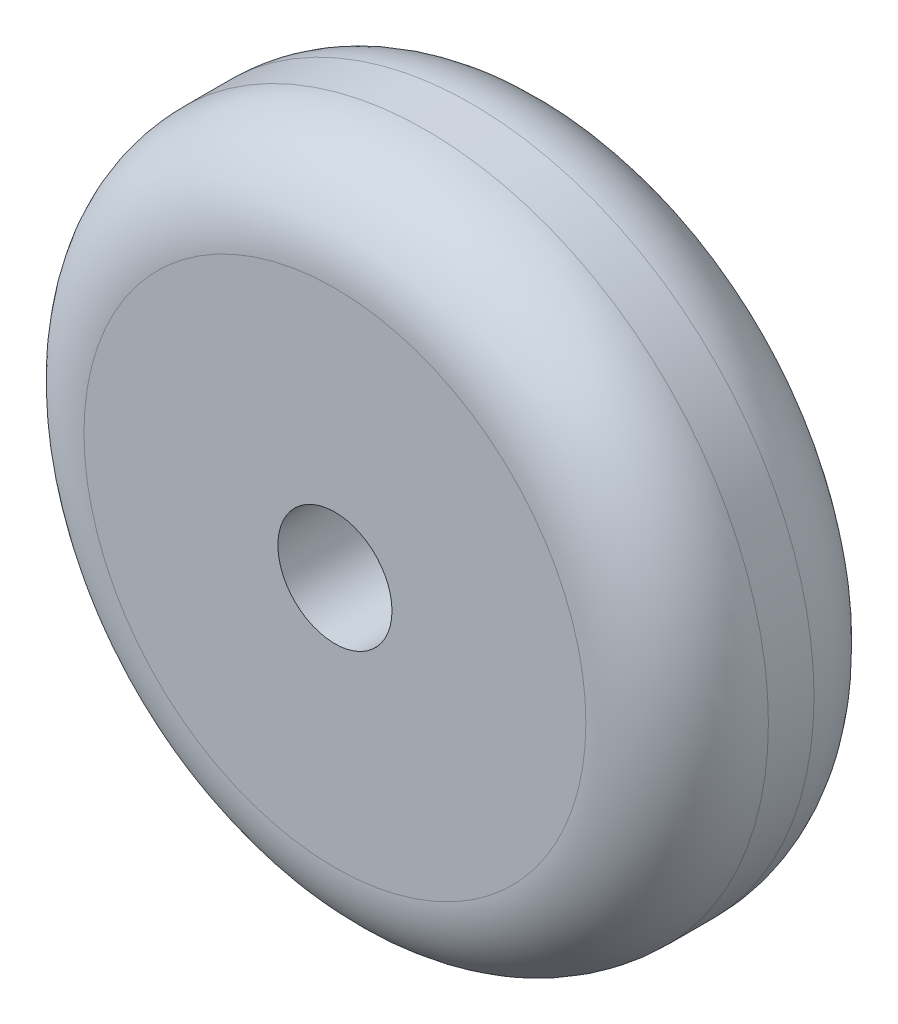
ISO-10303-21;
HEADER;
FILE_DESCRIPTION(('STEP AP214'),'2;1');
FILE_NAME('part.step','',(''),(''),'','','');
FILE_SCHEMA(('AUTOMOTIVE_DESIGN { 1 0 10303 214 1 1 1 1 }'));
ENDSEC;
DATA;
#1=APPLICATION_CONTEXT('core data for automotive mechanical design processes');
#2=APPLICATION_PROTOCOL_DEFINITION('international standard','automotive_design',2000,#1);
#3=PRODUCT_CONTEXT('',#1,'mechanical');
#4=PRODUCT('Part','Part','',(#3));
#5=PRODUCT_RELATED_PRODUCT_CATEGORY('part','',(#4));
#6=PRODUCT_DEFINITION_FORMATION('','',#4);
#7=PRODUCT_DEFINITION_CONTEXT('part definition',#1,'design');
#8=PRODUCT_DEFINITION('design','',#6,#7);
#9=PRODUCT_DEFINITION_SHAPE('','',#8);
#10=(LENGTH_UNIT() NAMED_UNIT(*) SI_UNIT(.MILLI.,.METRE.));
#11=(NAMED_UNIT(*) PLANE_ANGLE_UNIT() SI_UNIT($,.RADIAN.));
#12=(NAMED_UNIT(*) SI_UNIT($,.STERADIAN.) SOLID_ANGLE_UNIT());
#13=UNCERTAINTY_MEASURE_WITH_UNIT(LENGTH_MEASURE(1.E-05),#10,'distance_accuracy_value','');
#14=(GEOMETRIC_REPRESENTATION_CONTEXT(3) GLOBAL_UNCERTAINTY_ASSIGNED_CONTEXT((#13)) GLOBAL_UNIT_ASSIGNED_CONTEXT((#10,
#11,#12)) REPRESENTATION_CONTEXT('',''));
#15=CARTESIAN_POINT('',(0.,0.,0.));
#16=DIRECTION('',(0.,0.,1.));
#17=DIRECTION('',(1.,0.,0.));
#18=AXIS2_PLACEMENT_3D('',#15,#16,#17);
#19=CARTESIAN_POINT('',(0.,0.,50.));
#20=DIRECTION('',(0.,0.,-1.));
#21=DIRECTION('',(-1.,0.,0.));
#22=AXIS2_PLACEMENT_3D('',#19,#20,#21);
#23=CYLINDRICAL_SURFACE('',#22,75.);
#24=CARTESIAN_POINT('',(0.,0.,20.));
#25=DIRECTION('',(0.,0.,1.));
#26=DIRECTION('',(1.,0.,0.));
#27=AXIS2_PLACEMENT_3D('',#24,#25,#26);
#28=CIRCLE('',#27,75.);
#29=CARTESIAN_POINT('',(75.,0.,20.));
#30=VERTEX_POINT('',#29);
#31=EDGE_CURVE('E37',#30,#30,#28,.T.);
#32=ORIENTED_EDGE('',*,*,#31,.T.);
#33=EDGE_LOOP('',(#32));
#34=FACE_BOUND('',#33,.T.);
#35=CARTESIAN_POINT('',(0.,0.,30.));
#36=DIRECTION('',(0.,0.,1.));
#37=DIRECTION('',(1.,0.,0.));
#38=AXIS2_PLACEMENT_3D('',#35,#36,#37);
#39=CIRCLE('',#38,75.);
#40=CARTESIAN_POINT('',(75.,0.,30.));
#41=VERTEX_POINT('',#40);
#42=EDGE_CURVE('E41',#41,#41,#39,.F.);
#43=ORIENTED_EDGE('',*,*,#42,.T.);
#44=EDGE_LOOP('',(#43));
#45=FACE_BOUND('',#44,.T.);
#46=ADVANCED_FACE('F30',(#34,#45),#23,.T.);
#47=CARTESIAN_POINT('',(0.,0.,50.));
#48=DIRECTION('',(0.,0.,1.));
#49=DIRECTION('',(1.,0.,0.));
#50=AXIS2_PLACEMENT_3D('',#47,#48,#49);
#51=PLANE('',#50);
#52=CARTESIAN_POINT('',(0.,0.,50.));
#53=DIRECTION('',(0.,0.,1.));
#54=DIRECTION('',(1.,0.,0.));
#55=AXIS2_PLACEMENT_3D('',#52,#53,#54);
#56=CIRCLE('',#55,12.5);
#57=CARTESIAN_POINT('',(12.5,0.,50.));
#58=VERTEX_POINT('',#57);
#59=EDGE_CURVE('E51',#58,#58,#56,.T.);
#60=ORIENTED_EDGE('',*,*,#59,.F.);
#61=EDGE_LOOP('',(#60));
#62=FACE_BOUND('',#61,.T.);
#63=CARTESIAN_POINT('',(0.,0.,50.));
#64=DIRECTION('',(0.,0.,1.));
#65=DIRECTION('',(1.,0.,0.));
#66=AXIS2_PLACEMENT_3D('',#63,#64,#65);
#67=CIRCLE('',#66,55.);
#68=CARTESIAN_POINT('',(55.,0.,50.));
#69=VERTEX_POINT('',#68);
#70=EDGE_CURVE('E45',#69,#69,#67,.T.);
#71=ORIENTED_EDGE('',*,*,#70,.T.);
#72=EDGE_LOOP('',(#71));
#73=FACE_BOUND('',#72,.T.);
#74=ADVANCED_FACE('F65',(#62,#73),#51,.T.);
#75=CARTESIAN_POINT('',(0.,0.,0.));
#76=DIRECTION('',(0.,0.,1.));
#77=DIRECTION('',(1.,0.,0.));
#78=AXIS2_PLACEMENT_3D('',#75,#76,#77);
#79=PLANE('',#78);
#80=CARTESIAN_POINT('',(0.,0.,0.));
#81=DIRECTION('',(0.,0.,1.));
#82=DIRECTION('',(1.,0.,0.));
#83=AXIS2_PLACEMENT_3D('',#80,#81,#82);
#84=CIRCLE('',#83,12.5);
#85=CARTESIAN_POINT('',(12.5,0.,0.));
#86=VERTEX_POINT('',#85);
#87=EDGE_CURVE('E50',#86,#86,#84,.T.);
#88=ORIENTED_EDGE('',*,*,#87,.T.);
#89=EDGE_LOOP('',(#88));
#90=FACE_BOUND('',#89,.T.);
#91=CARTESIAN_POINT('',(0.,0.,0.));
#92=DIRECTION('',(0.,0.,1.));
#93=DIRECTION('',(1.,0.,0.));
#94=AXIS2_PLACEMENT_3D('',#91,#92,#93);
#95=CIRCLE('',#94,55.);
#96=CARTESIAN_POINT('',(55.,0.,0.));
#97=VERTEX_POINT('',#96);
#98=EDGE_CURVE('E10',#97,#97,#95,.F.);
#99=ORIENTED_EDGE('',*,*,#98,.T.);
#100=EDGE_LOOP('',(#99));
#101=FACE_BOUND('',#100,.T.);
#102=ADVANCED_FACE('F57',(#90,#101),#79,.F.);
#103=CARTESIAN_POINT('',(0.,0.,30.));
#104=DIRECTION('',(0.,0.,1.));
#105=DIRECTION('',(1.,0.,0.));
#106=AXIS2_PLACEMENT_3D('',#103,#104,#105);
#107=TOROIDAL_SURFACE('',#106,55.,20.);
#108=ORIENTED_EDGE('',*,*,#42,.F.);
#109=EDGE_LOOP('',(#108));
#110=FACE_BOUND('',#109,.T.);
#111=ORIENTED_EDGE('',*,*,#70,.F.);
#112=EDGE_LOOP('',(#111));
#113=FACE_BOUND('',#112,.T.);
#114=ADVANCED_FACE('F71',(#110,#113),#107,.T.);
#115=CARTESIAN_POINT('',(0.,0.,20.));
#116=DIRECTION('',(0.,0.,1.));
#117=DIRECTION('',(1.,0.,0.));
#118=AXIS2_PLACEMENT_3D('',#115,#116,#117);
#119=TOROIDAL_SURFACE('',#118,55.,20.);
#120=ORIENTED_EDGE('',*,*,#98,.F.);
#121=EDGE_LOOP('',(#120));
#122=FACE_BOUND('',#121,.T.);
#123=ORIENTED_EDGE('',*,*,#31,.F.);
#124=EDGE_LOOP('',(#123));
#125=FACE_BOUND('',#124,.T.);
#126=ADVANCED_FACE('F32',(#122,#125),#119,.T.);
#127=CARTESIAN_POINT('',(0.,0.,0.));
#128=DIRECTION('',(0.,0.,1.));
#129=DIRECTION('',(1.,0.,0.));
#130=AXIS2_PLACEMENT_3D('',#127,#128,#129);
#131=CYLINDRICAL_SURFACE('',#130,12.5);
#132=ORIENTED_EDGE('',*,*,#87,.F.);
#133=EDGE_LOOP('',(#132));
#134=FACE_BOUND('',#133,.T.);
#135=ORIENTED_EDGE('',*,*,#59,.T.);
#136=EDGE_LOOP('',(#135));
#137=FACE_BOUND('',#136,.T.);
#138=ADVANCED_FACE('F59',(#134,#137),#131,.F.);
#139=CLOSED_SHELL('',(#46,#74,#102,#114,#126,#138));
#140=MANIFOLD_SOLID_BREP('B2',#139);
#141=ADVANCED_BREP_SHAPE_REPRESENTATION('',(#18,#140),#14);
#142=SHAPE_DEFINITION_REPRESENTATION(#9,#141);
ENDSEC;
END-ISO-10303-21;
